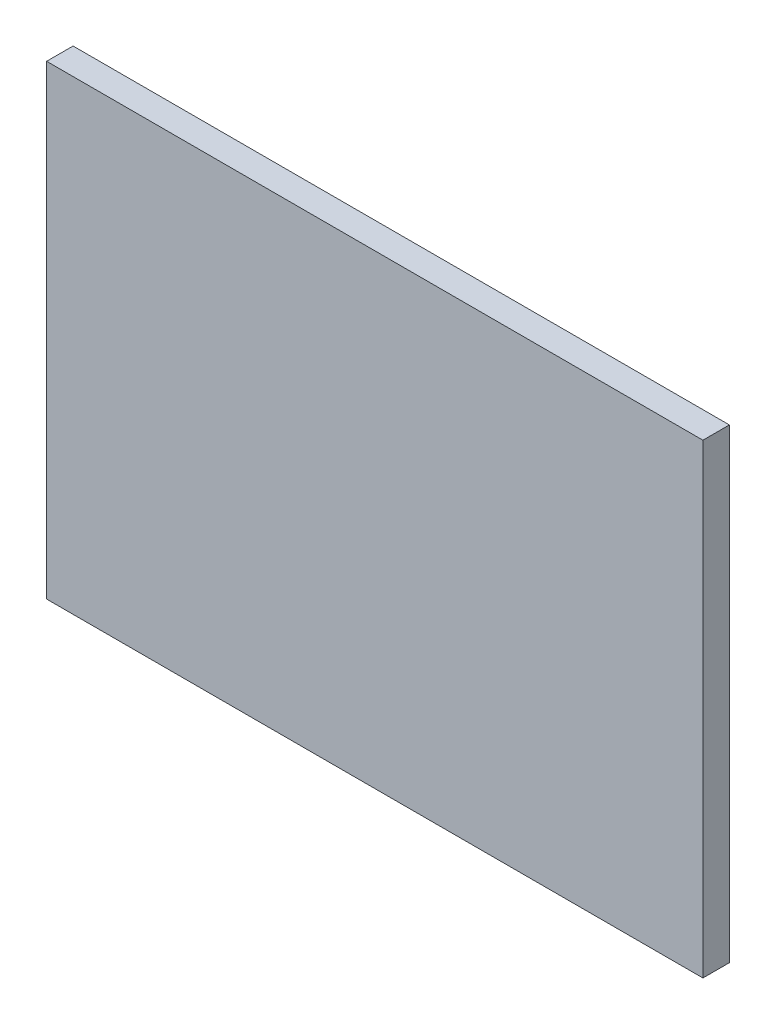
ISO-10303-21;
HEADER;
FILE_DESCRIPTION(('STEP AP214'),'2;1');
FILE_NAME('part.step','',(''),(''),'','','');
FILE_SCHEMA(('AUTOMOTIVE_DESIGN { 1 0 10303 214 1 1 1 1 }'));
ENDSEC;
DATA;
#1=APPLICATION_CONTEXT('core data for automotive mechanical design processes');
#2=APPLICATION_PROTOCOL_DEFINITION('international standard','automotive_design',2000,#1);
#3=PRODUCT_CONTEXT('',#1,'mechanical');
#4=PRODUCT('Part','Part','',(#3));
#5=PRODUCT_RELATED_PRODUCT_CATEGORY('part','',(#4));
#6=PRODUCT_DEFINITION_FORMATION('','',#4);
#7=PRODUCT_DEFINITION_CONTEXT('part definition',#1,'design');
#8=PRODUCT_DEFINITION('design','',#6,#7);
#9=PRODUCT_DEFINITION_SHAPE('','',#8);
#10=(LENGTH_UNIT() NAMED_UNIT(*) SI_UNIT(.MILLI.,.METRE.));
#11=(NAMED_UNIT(*) PLANE_ANGLE_UNIT() SI_UNIT($,.RADIAN.));
#12=(NAMED_UNIT(*) SI_UNIT($,.STERADIAN.) SOLID_ANGLE_UNIT());
#13=UNCERTAINTY_MEASURE_WITH_UNIT(LENGTH_MEASURE(1.E-05),#10,'distance_accuracy_value','');
#14=(GEOMETRIC_REPRESENTATION_CONTEXT(3) GLOBAL_UNCERTAINTY_ASSIGNED_CONTEXT((#13)) GLOBAL_UNIT_ASSIGNED_CONTEXT((#10,
#11,#12)) REPRESENTATION_CONTEXT('',''));
#15=CARTESIAN_POINT('',(0.,0.,0.));
#16=DIRECTION('',(0.,0.,1.));
#17=DIRECTION('',(1.,0.,0.));
#18=AXIS2_PLACEMENT_3D('',#15,#16,#17);
#19=CARTESIAN_POINT('',(0.,0.,31.75));
#20=DIRECTION('',(1.,0.,0.));
#21=DIRECTION('',(0.,0.,-1.));
#22=AXIS2_PLACEMENT_3D('',#19,#20,#21);
#23=PLANE('',#22);
#24=DIRECTION('',(0.,-1.,0.));
#25=VECTOR('',#24,1.);
#26=CARTESIAN_POINT('',(0.,0.,0.));
#27=LINE('',#26,#25);
#28=CARTESIAN_POINT('',(0.,558.8,0.));
#29=VERTEX_POINT('',#28);
#30=CARTESIAN_POINT('',(0.,0.,0.));
#31=VERTEX_POINT('',#30);
#32=EDGE_CURVE('E96',#29,#31,#27,.T.);
#33=ORIENTED_EDGE('',*,*,#32,.T.);
#34=DIRECTION('',(0.,0.,-1.));
#35=VECTOR('',#34,1.);
#36=CARTESIAN_POINT('',(0.,0.,31.75));
#37=LINE('',#36,#35);
#38=CARTESIAN_POINT('',(0.,0.,31.75));
#39=VERTEX_POINT('',#38);
#40=EDGE_CURVE('E11',#39,#31,#37,.T.);
#41=ORIENTED_EDGE('',*,*,#40,.F.);
#42=DIRECTION('',(0.,-1.,0.));
#43=VECTOR('',#42,1.);
#44=CARTESIAN_POINT('',(0.,0.,31.75));
#45=LINE('',#44,#43);
#46=CARTESIAN_POINT('',(0.,558.8,31.75));
#47=VERTEX_POINT('',#46);
#48=EDGE_CURVE('E84',#47,#39,#45,.T.);
#49=ORIENTED_EDGE('',*,*,#48,.F.);
#50=DIRECTION('',(0.,0.,-1.));
#51=VECTOR('',#50,1.);
#52=CARTESIAN_POINT('',(0.,558.8,31.75));
#53=LINE('',#52,#51);
#54=EDGE_CURVE('E92',#47,#29,#53,.T.);
#55=ORIENTED_EDGE('',*,*,#54,.T.);
#56=EDGE_LOOP('',(#33,#41,#49,#55));
#57=FACE_BOUND('',#56,.T.);
#58=ADVANCED_FACE('F33',(#57),#23,.F.);
#59=CARTESIAN_POINT('',(0.,0.,31.75));
#60=DIRECTION('',(0.,1.,0.));
#61=DIRECTION('',(0.,0.,1.));
#62=AXIS2_PLACEMENT_3D('',#59,#60,#61);
#63=PLANE('',#62);
#64=DIRECTION('',(1.,0.,0.));
#65=VECTOR('',#64,1.);
#66=CARTESIAN_POINT('',(0.,0.,0.));
#67=LINE('',#66,#65);
#68=CARTESIAN_POINT('',(787.4,0.,0.));
#69=VERTEX_POINT('',#68);
#70=EDGE_CURVE('E88',#31,#69,#67,.T.);
#71=ORIENTED_EDGE('',*,*,#70,.T.);
#72=DIRECTION('',(0.,0.,-1.));
#73=VECTOR('',#72,1.);
#74=CARTESIAN_POINT('',(787.4,0.,31.75));
#75=LINE('',#74,#73);
#76=CARTESIAN_POINT('',(787.4,0.,31.75));
#77=VERTEX_POINT('',#76);
#78=EDGE_CURVE('E41',#77,#69,#75,.T.);
#79=ORIENTED_EDGE('',*,*,#78,.F.);
#80=DIRECTION('',(1.,0.,0.));
#81=VECTOR('',#80,1.);
#82=CARTESIAN_POINT('',(0.,0.,31.75));
#83=LINE('',#82,#81);
#84=EDGE_CURVE('E79',#39,#77,#83,.T.);
#85=ORIENTED_EDGE('',*,*,#84,.F.);
#86=ORIENTED_EDGE('',*,*,#40,.T.);
#87=EDGE_LOOP('',(#71,#79,#85,#86));
#88=FACE_BOUND('',#87,.T.);
#89=ADVANCED_FACE('F87',(#88),#63,.F.);
#90=CARTESIAN_POINT('',(787.4,0.,31.75));
#91=DIRECTION('',(-1.,0.,0.));
#92=DIRECTION('',(0.,0.,1.));
#93=AXIS2_PLACEMENT_3D('',#90,#91,#92);
#94=PLANE('',#93);
#95=DIRECTION('',(0.,1.,0.));
#96=VECTOR('',#95,1.);
#97=CARTESIAN_POINT('',(787.4,0.,0.));
#98=LINE('',#97,#96);
#99=CARTESIAN_POINT('',(787.4,558.8,0.));
#100=VERTEX_POINT('',#99);
#101=EDGE_CURVE('E66',#69,#100,#98,.T.);
#102=ORIENTED_EDGE('',*,*,#101,.T.);
#103=DIRECTION('',(0.,0.,-1.));
#104=VECTOR('',#103,1.);
#105=CARTESIAN_POINT('',(787.4,558.8,31.75));
#106=LINE('',#105,#104);
#107=CARTESIAN_POINT('',(787.4,558.8,31.75));
#108=VERTEX_POINT('',#107);
#109=EDGE_CURVE('E89',#108,#100,#106,.T.);
#110=ORIENTED_EDGE('',*,*,#109,.F.);
#111=DIRECTION('',(0.,1.,0.));
#112=VECTOR('',#111,1.);
#113=CARTESIAN_POINT('',(787.4,0.,31.75));
#114=LINE('',#113,#112);
#115=EDGE_CURVE('E82',#77,#108,#114,.T.);
#116=ORIENTED_EDGE('',*,*,#115,.F.);
#117=ORIENTED_EDGE('',*,*,#78,.T.);
#118=EDGE_LOOP('',(#102,#110,#116,#117));
#119=FACE_BOUND('',#118,.T.);
#120=ADVANCED_FACE('F90',(#119),#94,.F.);
#121=CARTESIAN_POINT('',(0.,558.8,31.75));
#122=DIRECTION('',(0.,-1.,0.));
#123=DIRECTION('',(0.,0.,-1.));
#124=AXIS2_PLACEMENT_3D('',#121,#122,#123);
#125=PLANE('',#124);
#126=DIRECTION('',(-1.,0.,0.));
#127=VECTOR('',#126,1.);
#128=CARTESIAN_POINT('',(0.,558.8,0.));
#129=LINE('',#128,#127);
#130=EDGE_CURVE('E72',#100,#29,#129,.T.);
#131=ORIENTED_EDGE('',*,*,#130,.T.);
#132=ORIENTED_EDGE('',*,*,#54,.F.);
#133=DIRECTION('',(-1.,0.,0.));
#134=VECTOR('',#133,1.);
#135=CARTESIAN_POINT('',(0.,558.8,31.75));
#136=LINE('',#135,#134);
#137=EDGE_CURVE('E49',#108,#47,#136,.T.);
#138=ORIENTED_EDGE('',*,*,#137,.F.);
#139=ORIENTED_EDGE('',*,*,#109,.T.);
#140=EDGE_LOOP('',(#131,#132,#138,#139));
#141=FACE_BOUND('',#140,.T.);
#142=ADVANCED_FACE('F103',(#141),#125,.F.);
#143=CARTESIAN_POINT('',(0.,0.,31.75));
#144=DIRECTION('',(0.,0.,-1.));
#145=DIRECTION('',(-1.,0.,0.));
#146=AXIS2_PLACEMENT_3D('',#143,#144,#145);
#147=PLANE('',#146);
#148=ORIENTED_EDGE('',*,*,#48,.T.);
#149=ORIENTED_EDGE('',*,*,#84,.T.);
#150=ORIENTED_EDGE('',*,*,#115,.T.);
#151=ORIENTED_EDGE('',*,*,#137,.T.);
#152=EDGE_LOOP('',(#148,#149,#150,#151));
#153=FACE_BOUND('',#152,.T.);
#154=ADVANCED_FACE('F80',(#153),#147,.F.);
#155=CARTESIAN_POINT('',(0.,0.,0.));
#156=DIRECTION('',(0.,0.,-1.));
#157=DIRECTION('',(-1.,0.,0.));
#158=AXIS2_PLACEMENT_3D('',#155,#156,#157);
#159=PLANE('',#158);
#160=ORIENTED_EDGE('',*,*,#32,.F.);
#161=ORIENTED_EDGE('',*,*,#130,.F.);
#162=ORIENTED_EDGE('',*,*,#101,.F.);
#163=ORIENTED_EDGE('',*,*,#70,.F.);
#164=EDGE_LOOP('',(#160,#161,#162,#163));
#165=FACE_BOUND('',#164,.T.);
#166=ADVANCED_FACE('F106',(#165),#159,.T.);
#167=CLOSED_SHELL('',(#58,#89,#120,#142,#154,#166));
#168=MANIFOLD_SOLID_BREP('B2',#167);
#169=ADVANCED_BREP_SHAPE_REPRESENTATION('',(#18,#168),#14);
#170=SHAPE_DEFINITION_REPRESENTATION(#9,#169);
ENDSEC;
END-ISO-10303-21;
